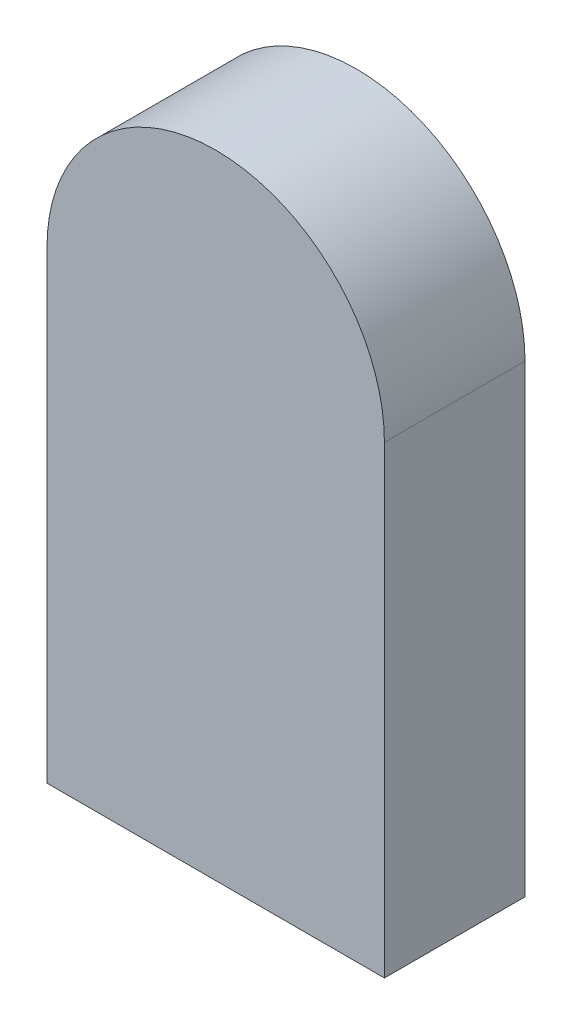
ISO-10303-21;
HEADER;
FILE_DESCRIPTION(('STEP AP214'),'2;1');
FILE_NAME('part.step','',(''),(''),'','','');
FILE_SCHEMA(('AUTOMOTIVE_DESIGN { 1 0 10303 214 1 1 1 1 }'));
ENDSEC;
DATA;
#1=APPLICATION_CONTEXT('core data for automotive mechanical design processes');
#2=APPLICATION_PROTOCOL_DEFINITION('international standard','automotive_design',2000,#1);
#3=PRODUCT_CONTEXT('',#1,'mechanical');
#4=PRODUCT('Part','Part','',(#3));
#5=PRODUCT_RELATED_PRODUCT_CATEGORY('part','',(#4));
#6=PRODUCT_DEFINITION_FORMATION('','',#4);
#7=PRODUCT_DEFINITION_CONTEXT('part definition',#1,'design');
#8=PRODUCT_DEFINITION('design','',#6,#7);
#9=PRODUCT_DEFINITION_SHAPE('','',#8);
#10=(LENGTH_UNIT() NAMED_UNIT(*) SI_UNIT(.MILLI.,.METRE.));
#11=(NAMED_UNIT(*) PLANE_ANGLE_UNIT() SI_UNIT($,.RADIAN.));
#12=(NAMED_UNIT(*) SI_UNIT($,.STERADIAN.) SOLID_ANGLE_UNIT());
#13=UNCERTAINTY_MEASURE_WITH_UNIT(LENGTH_MEASURE(1.E-05),#10,'distance_accuracy_value','');
#14=(GEOMETRIC_REPRESENTATION_CONTEXT(3) GLOBAL_UNCERTAINTY_ASSIGNED_CONTEXT((#13)) GLOBAL_UNIT_ASSIGNED_CONTEXT((#10,
#11,#12)) REPRESENTATION_CONTEXT('',''));
#15=CARTESIAN_POINT('',(0.,0.,0.));
#16=DIRECTION('',(0.,0.,1.));
#17=DIRECTION('',(1.,0.,0.));
#18=AXIS2_PLACEMENT_3D('',#15,#16,#17);
#19=CARTESIAN_POINT('',(2.63,-4.05,0.));
#20=DIRECTION('',(0.,1.,0.));
#21=DIRECTION('',(1.,0.,0.));
#22=AXIS2_PLACEMENT_3D('',#19,#20,#21);
#23=PLANE('',#22);
#24=DIRECTION('',(1.,0.,0.));
#25=VECTOR('',#24,1.);
#26=CARTESIAN_POINT('',(2.63,-4.05,0.));
#27=LINE('',#26,#25);
#28=CARTESIAN_POINT('',(2.63,-4.05,0.));
#29=VERTEX_POINT('',#28);
#30=CARTESIAN_POINT('',(2.87,-4.05,0.));
#31=VERTEX_POINT('',#30);
#32=EDGE_CURVE('E11',#29,#31,#27,.T.);
#33=ORIENTED_EDGE('',*,*,#32,.T.);
#34=DIRECTION('',(0.,0.,1.));
#35=VECTOR('',#34,1.);
#36=CARTESIAN_POINT('',(2.87,-4.05,0.));
#37=LINE('',#36,#35);
#38=CARTESIAN_POINT('',(2.87,-4.05,0.1));
#39=VERTEX_POINT('',#38);
#40=EDGE_CURVE('E24',#31,#39,#37,.T.);
#41=ORIENTED_EDGE('',*,*,#40,.T.);
#42=DIRECTION('',(1.,0.,0.));
#43=VECTOR('',#42,1.);
#44=CARTESIAN_POINT('',(2.63,-4.05,0.1));
#45=LINE('',#44,#43);
#46=CARTESIAN_POINT('',(2.63,-4.05,0.1));
#47=VERTEX_POINT('',#46);
#48=EDGE_CURVE('E87',#47,#39,#45,.T.);
#49=ORIENTED_EDGE('',*,*,#48,.F.);
#50=DIRECTION('',(0.,0.,1.));
#51=VECTOR('',#50,1.);
#52=CARTESIAN_POINT('',(2.63,-4.05,0.));
#53=LINE('',#52,#51);
#54=EDGE_CURVE('E36',#29,#47,#53,.T.);
#55=ORIENTED_EDGE('',*,*,#54,.F.);
#56=EDGE_LOOP('',(#33,#41,#49,#55));
#57=FACE_BOUND('',#56,.T.);
#58=ADVANCED_FACE('F17',(#57),#23,.F.);
#59=CARTESIAN_POINT('',(2.87,-4.05,0.));
#60=DIRECTION('',(-1.,0.,0.));
#61=DIRECTION('',(0.,1.,0.));
#62=AXIS2_PLACEMENT_3D('',#59,#60,#61);
#63=PLANE('',#62);
#64=DIRECTION('',(0.,1.,0.));
#65=VECTOR('',#64,1.);
#66=CARTESIAN_POINT('',(2.87,-4.05,0.));
#67=LINE('',#66,#65);
#68=CARTESIAN_POINT('',(2.87,-3.72,0.));
#69=VERTEX_POINT('',#68);
#70=EDGE_CURVE('E84',#31,#69,#67,.T.);
#71=ORIENTED_EDGE('',*,*,#70,.T.);
#72=DIRECTION('',(0.,0.,1.));
#73=VECTOR('',#72,1.);
#74=CARTESIAN_POINT('',(2.87,-3.72,0.));
#75=LINE('',#74,#73);
#76=CARTESIAN_POINT('',(2.87,-3.72,0.1));
#77=VERTEX_POINT('',#76);
#78=EDGE_CURVE('E82',#69,#77,#75,.T.);
#79=ORIENTED_EDGE('',*,*,#78,.T.);
#80=DIRECTION('',(0.,1.,0.));
#81=VECTOR('',#80,1.);
#82=CARTESIAN_POINT('',(2.87,-4.05,0.1));
#83=LINE('',#82,#81);
#84=EDGE_CURVE('E72',#39,#77,#83,.T.);
#85=ORIENTED_EDGE('',*,*,#84,.F.);
#86=ORIENTED_EDGE('',*,*,#40,.F.);
#87=EDGE_LOOP('',(#71,#79,#85,#86));
#88=FACE_BOUND('',#87,.T.);
#89=ADVANCED_FACE('F89',(#88),#63,.F.);
#90=CARTESIAN_POINT('',(2.75,-3.72,0.));
#91=DIRECTION('',(0.,0.,-1.));
#92=DIRECTION('',(1.,0.,0.));
#93=AXIS2_PLACEMENT_3D('',#90,#91,#92);
#94=CYLINDRICAL_SURFACE('',#93,0.12);
#95=CARTESIAN_POINT('',(2.75,-3.72,0.));
#96=DIRECTION('',(0.,0.,1.));
#97=DIRECTION('',(1.,0.,0.));
#98=AXIS2_PLACEMENT_3D('',#95,#96,#97);
#99=CIRCLE('',#98,0.12);
#100=CARTESIAN_POINT('',(2.63,-3.72,0.));
#101=VERTEX_POINT('',#100);
#102=EDGE_CURVE('E62',#69,#101,#99,.T.);
#103=ORIENTED_EDGE('',*,*,#102,.T.);
#104=DIRECTION('',(0.,0.,1.));
#105=VECTOR('',#104,1.);
#106=CARTESIAN_POINT('',(2.63,-3.72,0.));
#107=LINE('',#106,#105);
#108=CARTESIAN_POINT('',(2.63,-3.72,0.1));
#109=VERTEX_POINT('',#108);
#110=EDGE_CURVE('E57',#101,#109,#107,.T.);
#111=ORIENTED_EDGE('',*,*,#110,.T.);
#112=CARTESIAN_POINT('',(2.75,-3.72,0.1));
#113=DIRECTION('',(0.,0.,1.));
#114=DIRECTION('',(1.,0.,0.));
#115=AXIS2_PLACEMENT_3D('',#112,#113,#114);
#116=CIRCLE('',#115,0.12);
#117=EDGE_CURVE('E60',#77,#109,#116,.T.);
#118=ORIENTED_EDGE('',*,*,#117,.F.);
#119=ORIENTED_EDGE('',*,*,#78,.F.);
#120=EDGE_LOOP('',(#103,#111,#118,#119));
#121=FACE_BOUND('',#120,.T.);
#122=ADVANCED_FACE('F59',(#121),#94,.T.);
#123=CARTESIAN_POINT('',(2.63,-4.05,0.));
#124=DIRECTION('',(-1.,0.,0.));
#125=DIRECTION('',(0.,1.,0.));
#126=AXIS2_PLACEMENT_3D('',#123,#124,#125);
#127=PLANE('',#126);
#128=ORIENTED_EDGE('',*,*,#54,.T.);
#129=DIRECTION('',(0.,1.,0.));
#130=VECTOR('',#129,1.);
#131=CARTESIAN_POINT('',(2.63,-4.05,0.1));
#132=LINE('',#131,#130);
#133=EDGE_CURVE('E71',#47,#109,#132,.T.);
#134=ORIENTED_EDGE('',*,*,#133,.T.);
#135=ORIENTED_EDGE('',*,*,#110,.F.);
#136=DIRECTION('',(0.,1.,0.));
#137=VECTOR('',#136,1.);
#138=CARTESIAN_POINT('',(2.63,-4.05,0.));
#139=LINE('',#138,#137);
#140=EDGE_CURVE('E76',#29,#101,#139,.T.);
#141=ORIENTED_EDGE('',*,*,#140,.F.);
#142=EDGE_LOOP('',(#128,#134,#135,#141));
#143=FACE_BOUND('',#142,.T.);
#144=ADVANCED_FACE('F75',(#143),#127,.T.);
#145=CARTESIAN_POINT('',(2.75,-3.849490847913,0.));
#146=DIRECTION('',(0.,0.,1.));
#147=DIRECTION('',(1.,0.,0.));
#148=AXIS2_PLACEMENT_3D('',#145,#146,#147);
#149=PLANE('',#148);
#150=ORIENTED_EDGE('',*,*,#140,.T.);
#151=ORIENTED_EDGE('',*,*,#102,.F.);
#152=ORIENTED_EDGE('',*,*,#70,.F.);
#153=ORIENTED_EDGE('',*,*,#32,.F.);
#154=EDGE_LOOP('',(#150,#151,#152,#153));
#155=FACE_BOUND('',#154,.T.);
#156=ADVANCED_FACE('F91',(#155),#149,.F.);
#157=CARTESIAN_POINT('',(2.75,-3.849490847913,0.1));
#158=DIRECTION('',(0.,0.,1.));
#159=DIRECTION('',(1.,0.,0.));
#160=AXIS2_PLACEMENT_3D('',#157,#158,#159);
#161=PLANE('',#160);
#162=ORIENTED_EDGE('',*,*,#48,.T.);
#163=ORIENTED_EDGE('',*,*,#84,.T.);
#164=ORIENTED_EDGE('',*,*,#117,.T.);
#165=ORIENTED_EDGE('',*,*,#133,.F.);
#166=EDGE_LOOP('',(#162,#163,#164,#165));
#167=FACE_BOUND('',#166,.T.);
#168=ADVANCED_FACE('F70',(#167),#161,.T.);
#169=CLOSED_SHELL('',(#58,#89,#122,#144,#156,#168));
#170=MANIFOLD_SOLID_BREP('B1',#169);
#171=ADVANCED_BREP_SHAPE_REPRESENTATION('',(#18,#170),#14);
#172=SHAPE_DEFINITION_REPRESENTATION(#9,#171);
ENDSEC;
END-ISO-10303-21;
